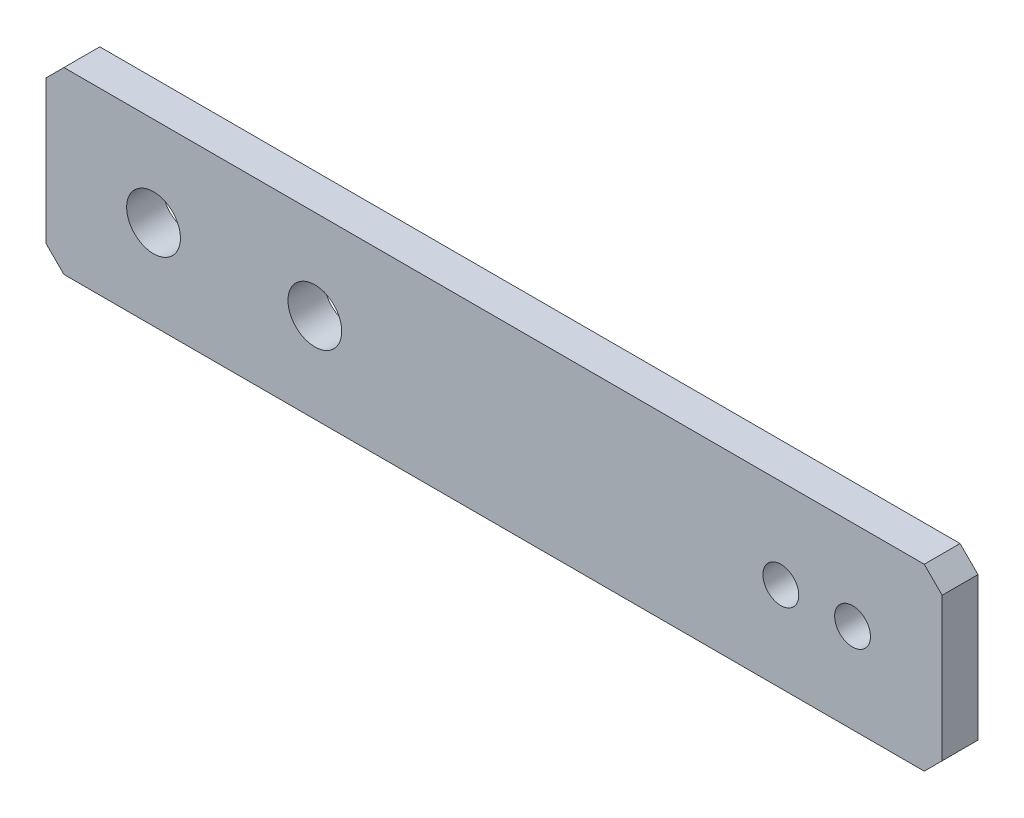
ISO-10303-21;
HEADER;
FILE_DESCRIPTION(('STEP AP214'),'2;1');
FILE_NAME('part.step','',(''),(''),'','','');
FILE_SCHEMA(('AUTOMOTIVE_DESIGN { 1 0 10303 214 1 1 1 1 }'));
ENDSEC;
DATA;
#1=APPLICATION_CONTEXT('core data for automotive mechanical design processes');
#2=APPLICATION_PROTOCOL_DEFINITION('international standard','automotive_design',2000,#1);
#3=PRODUCT_CONTEXT('',#1,'mechanical');
#4=PRODUCT('Part','Part','',(#3));
#5=PRODUCT_RELATED_PRODUCT_CATEGORY('part','',(#4));
#6=PRODUCT_DEFINITION_FORMATION('','',#4);
#7=PRODUCT_DEFINITION_CONTEXT('part definition',#1,'design');
#8=PRODUCT_DEFINITION('design','',#6,#7);
#9=PRODUCT_DEFINITION_SHAPE('','',#8);
#10=(LENGTH_UNIT() NAMED_UNIT(*) SI_UNIT(.MILLI.,.METRE.));
#11=(NAMED_UNIT(*) PLANE_ANGLE_UNIT() SI_UNIT($,.RADIAN.));
#12=(NAMED_UNIT(*) SI_UNIT($,.STERADIAN.) SOLID_ANGLE_UNIT());
#13=UNCERTAINTY_MEASURE_WITH_UNIT(LENGTH_MEASURE(1.E-05),#10,'distance_accuracy_value','');
#14=(GEOMETRIC_REPRESENTATION_CONTEXT(3) GLOBAL_UNCERTAINTY_ASSIGNED_CONTEXT((#13)) GLOBAL_UNIT_ASSIGNED_CONTEXT((#10,
#11,#12)) REPRESENTATION_CONTEXT('',''));
#15=CARTESIAN_POINT('',(0.,0.,0.));
#16=DIRECTION('',(0.,0.,1.));
#17=DIRECTION('',(1.,0.,0.));
#18=AXIS2_PLACEMENT_3D('',#15,#16,#17);
#19=CARTESIAN_POINT('',(0.,0.,2.));
#20=DIRECTION('',(0.,0.,1.));
#21=DIRECTION('',(1.,0.,0.));
#22=AXIS2_PLACEMENT_3D('',#19,#20,#21);
#23=PLANE('',#22);
#24=CARTESIAN_POINT('',(26.829307568438,4.38003220611916,2.));
#25=DIRECTION('',(0.,0.,1.));
#26=DIRECTION('',(1.,0.,0.));
#27=AXIS2_PLACEMENT_3D('',#24,#25,#26);
#28=CIRCLE('',#27,1.);
#29=CARTESIAN_POINT('',(27.829307568438,4.38003220611916,2.));
#30=VERTEX_POINT('',#29);
#31=EDGE_CURVE('E181',#30,#30,#28,.T.);
#32=ORIENTED_EDGE('',*,*,#31,.F.);
#33=EDGE_LOOP('',(#32));
#34=FACE_BOUND('',#33,.T.);
#35=CARTESIAN_POINT('',(-8.17069243156199,4.38003220611916,2.));
#36=DIRECTION('',(0.,0.,1.));
#37=DIRECTION('',(1.,0.,0.));
#38=AXIS2_PLACEMENT_3D('',#35,#36,#37);
#39=CIRCLE('',#38,1.5);
#40=CARTESIAN_POINT('',(-6.67069243156199,4.38003220611916,2.));
#41=VERTEX_POINT('',#40);
#42=EDGE_CURVE('E164',#41,#41,#39,.T.);
#43=ORIENTED_EDGE('',*,*,#42,.F.);
#44=EDGE_LOOP('',(#43));
#45=FACE_BOUND('',#44,.T.);
#46=DIRECTION('',(0.,1.,0.));
#47=VECTOR('',#46,1.);
#48=CARTESIAN_POINT('',(35.829307568438,9.38003220611916,2.));
#49=LINE('',#48,#47);
#50=CARTESIAN_POINT('',(35.829307568438,0.380032206119164,2.));
#51=VERTEX_POINT('',#50);
#52=CARTESIAN_POINT('',(35.829307568438,8.38003220611916,2.));
#53=VERTEX_POINT('',#52);
#54=EDGE_CURVE('E171',#51,#53,#49,.T.);
#55=ORIENTED_EDGE('',*,*,#54,.T.);
#56=DIRECTION('',(0.707106781186543,-0.707106781186552,0.));
#57=VECTOR('',#56,1.);
#58=CARTESIAN_POINT('',(22.1046698872788,22.1046698872785,2.));
#59=LINE('',#58,#57);
#60=CARTESIAN_POINT('',(34.829307568438,9.38003220611916,2.));
#61=VERTEX_POINT('',#60);
#62=EDGE_CURVE('E148',#53,#61,#59,.F.);
#63=ORIENTED_EDGE('',*,*,#62,.T.);
#64=DIRECTION('',(-1.,0.,0.));
#65=VECTOR('',#64,1.);
#66=CARTESIAN_POINT('',(-14.170692431562,9.38003220611916,2.));
#67=LINE('',#66,#65);
#68=CARTESIAN_POINT('',(-13.170692431562,9.38003220611916,2.));
#69=VERTEX_POINT('',#68);
#70=EDGE_CURVE('E119',#61,#69,#67,.T.);
#71=ORIENTED_EDGE('',*,*,#70,.T.);
#72=DIRECTION('',(0.707106781186548,0.707106781186548,0.));
#73=VECTOR('',#72,1.);
#74=CARTESIAN_POINT('',(-11.2753623188406,11.2753623188406,2.));
#75=LINE('',#74,#73);
#76=CARTESIAN_POINT('',(-14.170692431562,8.38003220611916,2.));
#77=VERTEX_POINT('',#76);
#78=EDGE_CURVE('E143',#69,#77,#75,.F.);
#79=ORIENTED_EDGE('',*,*,#78,.T.);
#80=DIRECTION('',(0.,-1.,0.));
#81=VECTOR('',#80,1.);
#82=CARTESIAN_POINT('',(-14.170692431562,9.38003220611916,2.));
#83=LINE('',#82,#81);
#84=CARTESIAN_POINT('',(-14.170692431562,0.380032206119171,2.));
#85=VERTEX_POINT('',#84);
#86=EDGE_CURVE('E126',#77,#85,#83,.T.);
#87=ORIENTED_EDGE('',*,*,#86,.T.);
#88=DIRECTION('',(-0.707106781186548,0.707106781186548,0.));
#89=VECTOR('',#88,1.);
#90=CARTESIAN_POINT('',(-6.89533011272141,-6.89533011272141,2.));
#91=LINE('',#90,#89);
#92=CARTESIAN_POINT('',(-13.170692431562,-0.619967793880837,2.));
#93=VERTEX_POINT('',#92);
#94=EDGE_CURVE('E55',#85,#93,#91,.F.);
#95=ORIENTED_EDGE('',*,*,#94,.T.);
#96=DIRECTION('',(1.,0.,0.));
#97=VECTOR('',#96,1.);
#98=CARTESIAN_POINT('',(-14.170692431562,-0.619967793880837,2.));
#99=LINE('',#98,#97);
#100=CARTESIAN_POINT('',(34.829307568438,-0.619967793880837,2.));
#101=VERTEX_POINT('',#100);
#102=EDGE_CURVE('E129',#93,#101,#99,.T.);
#103=ORIENTED_EDGE('',*,*,#102,.T.);
#104=DIRECTION('',(-0.707106781186548,-0.707106781186548,0.));
#105=VECTOR('',#104,1.);
#106=CARTESIAN_POINT('',(17.7246376811594,-17.7246376811594,2.));
#107=LINE('',#106,#105);
#108=EDGE_CURVE('E146',#101,#51,#107,.F.);
#109=ORIENTED_EDGE('',*,*,#108,.T.);
#110=EDGE_LOOP('',(#55,#63,#71,#79,#87,#95,#103,#109));
#111=FACE_BOUND('',#110,.T.);
#112=CARTESIAN_POINT('',(0.829307568438007,4.38003220611916,2.));
#113=DIRECTION('',(0.,0.,1.));
#114=DIRECTION('',(1.,0.,0.));
#115=AXIS2_PLACEMENT_3D('',#112,#113,#114);
#116=CIRCLE('',#115,1.5);
#117=CARTESIAN_POINT('',(2.32930756843801,4.38003220611916,2.));
#118=VERTEX_POINT('',#117);
#119=EDGE_CURVE('E176',#118,#118,#116,.T.);
#120=ORIENTED_EDGE('',*,*,#119,.F.);
#121=EDGE_LOOP('',(#120));
#122=FACE_BOUND('',#121,.T.);
#123=CARTESIAN_POINT('',(30.829307568438,4.38003220611916,2.));
#124=DIRECTION('',(0.,0.,1.));
#125=DIRECTION('',(1.,0.,0.));
#126=AXIS2_PLACEMENT_3D('',#123,#124,#125);
#127=CIRCLE('',#126,0.999999999999994);
#128=CARTESIAN_POINT('',(31.829307568438,4.38003220611916,2.));
#129=VERTEX_POINT('',#128);
#130=EDGE_CURVE('E187',#129,#129,#127,.T.);
#131=ORIENTED_EDGE('',*,*,#130,.F.);
#132=EDGE_LOOP('',(#131));
#133=FACE_BOUND('',#132,.T.);
#134=ADVANCED_FACE('F33',(#34,#45,#111,#122,#133),#23,.T.);
#135=CARTESIAN_POINT('',(0.,0.,0.));
#136=DIRECTION('',(0.,0.,1.));
#137=DIRECTION('',(1.,0.,0.));
#138=AXIS2_PLACEMENT_3D('',#135,#136,#137);
#139=PLANE('',#138);
#140=DIRECTION('',(-1.,0.,0.));
#141=VECTOR('',#140,1.);
#142=CARTESIAN_POINT('',(-14.170692431562,9.38003220611916,0.));
#143=LINE('',#142,#141);
#144=CARTESIAN_POINT('',(34.829307568438,9.38003220611916,0.));
#145=VERTEX_POINT('',#144);
#146=CARTESIAN_POINT('',(-13.170692431562,9.38003220611916,0.));
#147=VERTEX_POINT('',#146);
#148=EDGE_CURVE('E116',#145,#147,#143,.T.);
#149=ORIENTED_EDGE('',*,*,#148,.F.);
#150=DIRECTION('',(-0.707106781186543,0.707106781186552,0.));
#151=VECTOR('',#150,1.);
#152=CARTESIAN_POINT('',(34.829307568438,9.38003220611916,0.));
#153=LINE('',#152,#151);
#154=CARTESIAN_POINT('',(35.829307568438,8.38003220611916,0.));
#155=VERTEX_POINT('',#154);
#156=EDGE_CURVE('E99',#145,#155,#153,.F.);
#157=ORIENTED_EDGE('',*,*,#156,.T.);
#158=DIRECTION('',(0.,1.,0.));
#159=VECTOR('',#158,1.);
#160=CARTESIAN_POINT('',(35.829307568438,9.38003220611916,0.));
#161=LINE('',#160,#159);
#162=CARTESIAN_POINT('',(35.829307568438,0.380032206119164,0.));
#163=VERTEX_POINT('',#162);
#164=EDGE_CURVE('E127',#163,#155,#161,.T.);
#165=ORIENTED_EDGE('',*,*,#164,.F.);
#166=DIRECTION('',(0.707106781186548,0.707106781186548,0.));
#167=VECTOR('',#166,1.);
#168=CARTESIAN_POINT('',(35.829307568438,0.380032206119164,0.));
#169=LINE('',#168,#167);
#170=CARTESIAN_POINT('',(34.829307568438,-0.619967793880837,0.));
#171=VERTEX_POINT('',#170);
#172=EDGE_CURVE('E110',#163,#171,#169,.F.);
#173=ORIENTED_EDGE('',*,*,#172,.T.);
#174=DIRECTION('',(1.,0.,0.));
#175=VECTOR('',#174,1.);
#176=CARTESIAN_POINT('',(-14.170692431562,-0.619967793880837,0.));
#177=LINE('',#176,#175);
#178=CARTESIAN_POINT('',(-13.170692431562,-0.619967793880837,0.));
#179=VERTEX_POINT('',#178);
#180=EDGE_CURVE('E131',#179,#171,#177,.T.);
#181=ORIENTED_EDGE('',*,*,#180,.F.);
#182=DIRECTION('',(0.707106781186548,-0.707106781186548,0.));
#183=VECTOR('',#182,1.);
#184=CARTESIAN_POINT('',(-13.170692431562,-0.619967793880837,0.));
#185=LINE('',#184,#183);
#186=CARTESIAN_POINT('',(-14.170692431562,0.380032206119171,0.));
#187=VERTEX_POINT('',#186);
#188=EDGE_CURVE('E137',#179,#187,#185,.F.);
#189=ORIENTED_EDGE('',*,*,#188,.T.);
#190=DIRECTION('',(0.,-1.,0.));
#191=VECTOR('',#190,1.);
#192=CARTESIAN_POINT('',(-14.170692431562,9.38003220611916,0.));
#193=LINE('',#192,#191);
#194=CARTESIAN_POINT('',(-14.170692431562,8.38003220611916,0.));
#195=VERTEX_POINT('',#194);
#196=EDGE_CURVE('E159',#195,#187,#193,.T.);
#197=ORIENTED_EDGE('',*,*,#196,.F.);
#198=DIRECTION('',(-0.707106781186548,-0.707106781186548,0.));
#199=VECTOR('',#198,1.);
#200=CARTESIAN_POINT('',(-14.170692431562,8.38003220611916,0.));
#201=LINE('',#200,#199);
#202=EDGE_CURVE('E120',#195,#147,#201,.F.);
#203=ORIENTED_EDGE('',*,*,#202,.T.);
#204=EDGE_LOOP('',(#149,#157,#165,#173,#181,#189,#197,#203));
#205=FACE_BOUND('',#204,.T.);
#206=CARTESIAN_POINT('',(-8.17069243156199,4.38003220611916,0.));
#207=DIRECTION('',(0.,0.,1.));
#208=DIRECTION('',(1.,0.,0.));
#209=AXIS2_PLACEMENT_3D('',#206,#207,#208);
#210=CIRCLE('',#209,1.5);
#211=CARTESIAN_POINT('',(-6.67069243156199,4.38003220611916,0.));
#212=VERTEX_POINT('',#211);
#213=EDGE_CURVE('E167',#212,#212,#210,.T.);
#214=ORIENTED_EDGE('',*,*,#213,.T.);
#215=EDGE_LOOP('',(#214));
#216=FACE_BOUND('',#215,.T.);
#217=CARTESIAN_POINT('',(0.829307568438007,4.38003220611916,0.));
#218=DIRECTION('',(0.,0.,1.));
#219=DIRECTION('',(1.,0.,0.));
#220=AXIS2_PLACEMENT_3D('',#217,#218,#219);
#221=CIRCLE('',#220,1.5);
#222=CARTESIAN_POINT('',(2.32930756843801,4.38003220611916,0.));
#223=VERTEX_POINT('',#222);
#224=EDGE_CURVE('E178',#223,#223,#221,.T.);
#225=ORIENTED_EDGE('',*,*,#224,.T.);
#226=EDGE_LOOP('',(#225));
#227=FACE_BOUND('',#226,.T.);
#228=CARTESIAN_POINT('',(26.829307568438,4.38003220611916,0.));
#229=DIRECTION('',(0.,0.,1.));
#230=DIRECTION('',(1.,0.,0.));
#231=AXIS2_PLACEMENT_3D('',#228,#229,#230);
#232=CIRCLE('',#231,1.);
#233=CARTESIAN_POINT('',(27.829307568438,4.38003220611916,0.));
#234=VERTEX_POINT('',#233);
#235=EDGE_CURVE('E184',#234,#234,#232,.T.);
#236=ORIENTED_EDGE('',*,*,#235,.T.);
#237=EDGE_LOOP('',(#236));
#238=FACE_BOUND('',#237,.T.);
#239=CARTESIAN_POINT('',(30.829307568438,4.38003220611916,0.));
#240=DIRECTION('',(0.,0.,1.));
#241=DIRECTION('',(1.,0.,0.));
#242=AXIS2_PLACEMENT_3D('',#239,#240,#241);
#243=CIRCLE('',#242,0.999999999999994);
#244=CARTESIAN_POINT('',(31.829307568438,4.38003220611916,0.));
#245=VERTEX_POINT('',#244);
#246=EDGE_CURVE('E190',#245,#245,#243,.T.);
#247=ORIENTED_EDGE('',*,*,#246,.T.);
#248=EDGE_LOOP('',(#247));
#249=FACE_BOUND('',#248,.T.);
#250=ADVANCED_FACE('F123',(#205,#216,#227,#238,#249),#139,.F.);
#251=CARTESIAN_POINT('',(-14.170692431562,9.38003220611916,2.));
#252=DIRECTION('',(1.,0.,0.));
#253=DIRECTION('',(0.,1.,0.));
#254=AXIS2_PLACEMENT_3D('',#251,#252,#253);
#255=PLANE('',#254);
#256=ORIENTED_EDGE('',*,*,#196,.T.);
#257=DIRECTION('',(0.,0.,1.));
#258=VECTOR('',#257,1.);
#259=CARTESIAN_POINT('',(-14.170692431562,0.380032206119171,2.));
#260=LINE('',#259,#258);
#261=EDGE_CURVE('E11',#187,#85,#260,.T.);
#262=ORIENTED_EDGE('',*,*,#261,.T.);
#263=ORIENTED_EDGE('',*,*,#86,.F.);
#264=DIRECTION('',(0.,0.,-1.));
#265=VECTOR('',#264,1.);
#266=CARTESIAN_POINT('',(-14.170692431562,8.38003220611916,2.));
#267=LINE('',#266,#265);
#268=EDGE_CURVE('E41',#77,#195,#267,.T.);
#269=ORIENTED_EDGE('',*,*,#268,.T.);
#270=EDGE_LOOP('',(#256,#262,#263,#269));
#271=FACE_BOUND('',#270,.T.);
#272=ADVANCED_FACE('F158',(#271),#255,.F.);
#273=CARTESIAN_POINT('',(-14.170692431562,-0.619967793880837,2.));
#274=DIRECTION('',(0.,1.,0.));
#275=DIRECTION('',(0.,0.,1.));
#276=AXIS2_PLACEMENT_3D('',#273,#274,#275);
#277=PLANE('',#276);
#278=ORIENTED_EDGE('',*,*,#180,.T.);
#279=DIRECTION('',(0.,0.,1.));
#280=VECTOR('',#279,1.);
#281=CARTESIAN_POINT('',(34.829307568438,-0.619967793880837,2.));
#282=LINE('',#281,#280);
#283=EDGE_CURVE('E48',#171,#101,#282,.T.);
#284=ORIENTED_EDGE('',*,*,#283,.T.);
#285=ORIENTED_EDGE('',*,*,#102,.F.);
#286=DIRECTION('',(0.,0.,-1.));
#287=VECTOR('',#286,1.);
#288=CARTESIAN_POINT('',(-13.170692431562,-0.619967793880837,2.));
#289=LINE('',#288,#287);
#290=EDGE_CURVE('E150',#93,#179,#289,.T.);
#291=ORIENTED_EDGE('',*,*,#290,.T.);
#292=EDGE_LOOP('',(#278,#284,#285,#291));
#293=FACE_BOUND('',#292,.T.);
#294=ADVANCED_FACE('F217',(#293),#277,.F.);
#295=CARTESIAN_POINT('',(35.829307568438,9.38003220611916,2.));
#296=DIRECTION('',(-1.,0.,0.));
#297=DIRECTION('',(0.,0.,1.));
#298=AXIS2_PLACEMENT_3D('',#295,#296,#297);
#299=PLANE('',#298);
#300=ORIENTED_EDGE('',*,*,#164,.T.);
#301=DIRECTION('',(0.,0.,1.));
#302=VECTOR('',#301,1.);
#303=CARTESIAN_POINT('',(35.829307568438,8.38003220611916,2.));
#304=LINE('',#303,#302);
#305=EDGE_CURVE('E104',#155,#53,#304,.T.);
#306=ORIENTED_EDGE('',*,*,#305,.T.);
#307=ORIENTED_EDGE('',*,*,#54,.F.);
#308=DIRECTION('',(0.,0.,-1.));
#309=VECTOR('',#308,1.);
#310=CARTESIAN_POINT('',(35.829307568438,0.380032206119164,2.));
#311=LINE('',#310,#309);
#312=EDGE_CURVE('E109',#51,#163,#311,.T.);
#313=ORIENTED_EDGE('',*,*,#312,.T.);
#314=EDGE_LOOP('',(#300,#306,#307,#313));
#315=FACE_BOUND('',#314,.T.);
#316=ADVANCED_FACE('F214',(#315),#299,.F.);
#317=CARTESIAN_POINT('',(-14.170692431562,9.38003220611916,2.));
#318=DIRECTION('',(0.,-1.,0.));
#319=DIRECTION('',(1.,0.,0.));
#320=AXIS2_PLACEMENT_3D('',#317,#318,#319);
#321=PLANE('',#320);
#322=ORIENTED_EDGE('',*,*,#70,.F.);
#323=DIRECTION('',(0.,0.,-1.));
#324=VECTOR('',#323,1.);
#325=CARTESIAN_POINT('',(34.829307568438,9.38003220611916,2.));
#326=LINE('',#325,#324);
#327=EDGE_CURVE('E103',#61,#145,#326,.T.);
#328=ORIENTED_EDGE('',*,*,#327,.T.);
#329=ORIENTED_EDGE('',*,*,#148,.T.);
#330=DIRECTION('',(0.,0.,1.));
#331=VECTOR('',#330,1.);
#332=CARTESIAN_POINT('',(-13.170692431562,9.38003220611916,2.));
#333=LINE('',#332,#331);
#334=EDGE_CURVE('E121',#147,#69,#333,.T.);
#335=ORIENTED_EDGE('',*,*,#334,.T.);
#336=EDGE_LOOP('',(#322,#328,#329,#335));
#337=FACE_BOUND('',#336,.T.);
#338=ADVANCED_FACE('F115',(#337),#321,.F.);
#339=CARTESIAN_POINT('',(-8.17069243156199,4.38003220611916,2.));
#340=DIRECTION('',(0.,0.,-1.));
#341=DIRECTION('',(-1.,0.,0.));
#342=AXIS2_PLACEMENT_3D('',#339,#340,#341);
#343=CYLINDRICAL_SURFACE('',#342,1.5);
#344=ORIENTED_EDGE('',*,*,#42,.T.);
#345=EDGE_LOOP('',(#344));
#346=FACE_BOUND('',#345,.T.);
#347=ORIENTED_EDGE('',*,*,#213,.F.);
#348=EDGE_LOOP('',(#347));
#349=FACE_BOUND('',#348,.T.);
#350=ADVANCED_FACE('F209',(#346,#349),#343,.F.);
#351=CARTESIAN_POINT('',(0.829307568438007,4.38003220611916,2.));
#352=DIRECTION('',(0.,0.,-1.));
#353=DIRECTION('',(-1.,0.,0.));
#354=AXIS2_PLACEMENT_3D('',#351,#352,#353);
#355=CYLINDRICAL_SURFACE('',#354,1.5);
#356=ORIENTED_EDGE('',*,*,#119,.T.);
#357=EDGE_LOOP('',(#356));
#358=FACE_BOUND('',#357,.T.);
#359=ORIENTED_EDGE('',*,*,#224,.F.);
#360=EDGE_LOOP('',(#359));
#361=FACE_BOUND('',#360,.T.);
#362=ADVANCED_FACE('F241',(#358,#361),#355,.F.);
#363=CARTESIAN_POINT('',(26.829307568438,4.38003220611916,2.));
#364=DIRECTION('',(0.,0.,-1.));
#365=DIRECTION('',(-1.,0.,0.));
#366=AXIS2_PLACEMENT_3D('',#363,#364,#365);
#367=CYLINDRICAL_SURFACE('',#366,1.);
#368=ORIENTED_EDGE('',*,*,#31,.T.);
#369=EDGE_LOOP('',(#368));
#370=FACE_BOUND('',#369,.T.);
#371=ORIENTED_EDGE('',*,*,#235,.F.);
#372=EDGE_LOOP('',(#371));
#373=FACE_BOUND('',#372,.T.);
#374=ADVANCED_FACE('F244',(#370,#373),#367,.F.);
#375=CARTESIAN_POINT('',(30.829307568438,4.38003220611916,2.));
#376=DIRECTION('',(0.,0.,-1.));
#377=DIRECTION('',(-1.,0.,0.));
#378=AXIS2_PLACEMENT_3D('',#375,#376,#377);
#379=CYLINDRICAL_SURFACE('',#378,0.999999999999994);
#380=ORIENTED_EDGE('',*,*,#130,.T.);
#381=EDGE_LOOP('',(#380));
#382=FACE_BOUND('',#381,.T.);
#383=ORIENTED_EDGE('',*,*,#246,.F.);
#384=EDGE_LOOP('',(#383));
#385=FACE_BOUND('',#384,.T.);
#386=ADVANCED_FACE('F196',(#382,#385),#379,.F.);
#387=CARTESIAN_POINT('',(34.829307568438,9.38003220611916,2.));
#388=DIRECTION('',(-0.707106781186552,-0.707106781186543,0.));
#389=DIRECTION('',(0.,0.,-1.));
#390=AXIS2_PLACEMENT_3D('',#387,#388,#389);
#391=PLANE('',#390);
#392=ORIENTED_EDGE('',*,*,#62,.F.);
#393=ORIENTED_EDGE('',*,*,#305,.F.);
#394=ORIENTED_EDGE('',*,*,#156,.F.);
#395=ORIENTED_EDGE('',*,*,#327,.F.);
#396=EDGE_LOOP('',(#392,#393,#394,#395));
#397=FACE_BOUND('',#396,.T.);
#398=ADVANCED_FACE('F102',(#397),#391,.F.);
#399=CARTESIAN_POINT('',(35.829307568438,0.380032206119164,2.));
#400=DIRECTION('',(-0.707106781186547,0.707106781186547,0.));
#401=DIRECTION('',(0.,0.,-1.));
#402=AXIS2_PLACEMENT_3D('',#399,#400,#401);
#403=PLANE('',#402);
#404=ORIENTED_EDGE('',*,*,#108,.F.);
#405=ORIENTED_EDGE('',*,*,#283,.F.);
#406=ORIENTED_EDGE('',*,*,#172,.F.);
#407=ORIENTED_EDGE('',*,*,#312,.F.);
#408=EDGE_LOOP('',(#404,#405,#406,#407));
#409=FACE_BOUND('',#408,.T.);
#410=ADVANCED_FACE('F225',(#409),#403,.F.);
#411=CARTESIAN_POINT('',(-13.170692431562,-0.619967793880837,2.));
#412=DIRECTION('',(0.707106781186547,0.707106781186547,0.));
#413=DIRECTION('',(0.,0.,-1.));
#414=AXIS2_PLACEMENT_3D('',#411,#412,#413);
#415=PLANE('',#414);
#416=ORIENTED_EDGE('',*,*,#94,.F.);
#417=ORIENTED_EDGE('',*,*,#261,.F.);
#418=ORIENTED_EDGE('',*,*,#188,.F.);
#419=ORIENTED_EDGE('',*,*,#290,.F.);
#420=EDGE_LOOP('',(#416,#417,#418,#419));
#421=FACE_BOUND('',#420,.T.);
#422=ADVANCED_FACE('F227',(#421),#415,.F.);
#423=CARTESIAN_POINT('',(-14.170692431562,8.38003220611916,2.));
#424=DIRECTION('',(0.707106781186547,-0.707106781186547,0.));
#425=DIRECTION('',(0.,0.,-1.));
#426=AXIS2_PLACEMENT_3D('',#423,#424,#425);
#427=PLANE('',#426);
#428=ORIENTED_EDGE('',*,*,#78,.F.);
#429=ORIENTED_EDGE('',*,*,#334,.F.);
#430=ORIENTED_EDGE('',*,*,#202,.F.);
#431=ORIENTED_EDGE('',*,*,#268,.F.);
#432=EDGE_LOOP('',(#428,#429,#430,#431));
#433=FACE_BOUND('',#432,.T.);
#434=ADVANCED_FACE('F35',(#433),#427,.F.);
#435=CLOSED_SHELL('',(#134,#250,#272,#294,#316,#338,#350,#362,#374,#386,#398,#410,#422,#434));
#436=MANIFOLD_SOLID_BREP('B2',#435);
#437=ADVANCED_BREP_SHAPE_REPRESENTATION('',(#18,#436),#14);
#438=SHAPE_DEFINITION_REPRESENTATION(#9,#437);
ENDSEC;
END-ISO-10303-21;
